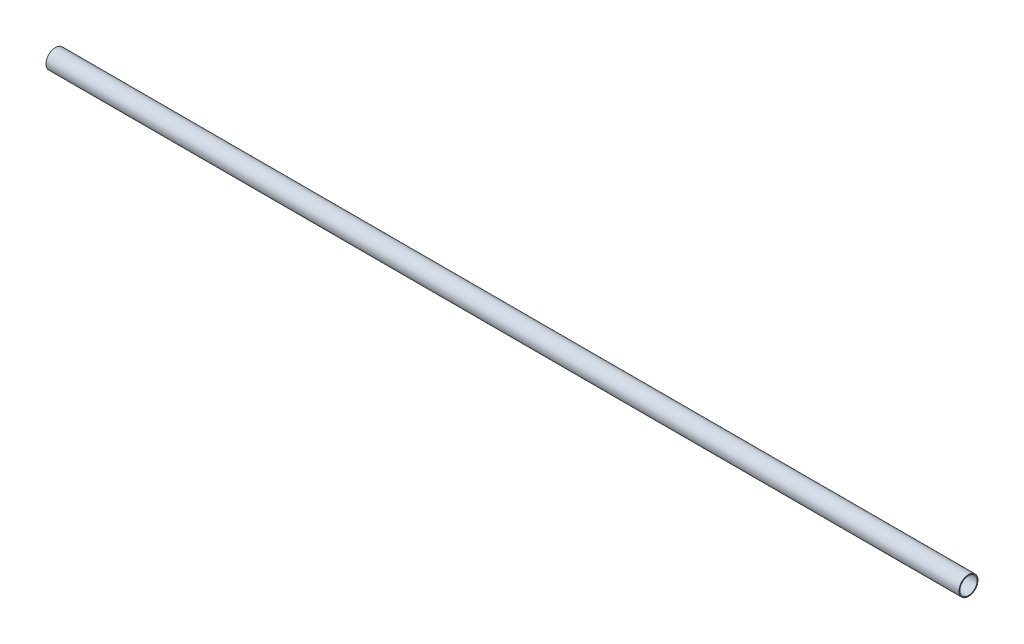
ISO-10303-21;
HEADER;
FILE_DESCRIPTION(('STEP AP214'),'2;1');
FILE_NAME('part.step','',(''),(''),'','','');
FILE_SCHEMA(('AUTOMOTIVE_DESIGN { 1 0 10303 214 1 1 1 1 }'));
ENDSEC;
DATA;
#1=APPLICATION_CONTEXT('core data for automotive mechanical design processes');
#2=APPLICATION_PROTOCOL_DEFINITION('international standard','automotive_design',2000,#1);
#3=PRODUCT_CONTEXT('',#1,'mechanical');
#4=PRODUCT('Part','Part','',(#3));
#5=PRODUCT_RELATED_PRODUCT_CATEGORY('part','',(#4));
#6=PRODUCT_DEFINITION_FORMATION('','',#4);
#7=PRODUCT_DEFINITION_CONTEXT('part definition',#1,'design');
#8=PRODUCT_DEFINITION('design','',#6,#7);
#9=PRODUCT_DEFINITION_SHAPE('','',#8);
#10=(LENGTH_UNIT() NAMED_UNIT(*) SI_UNIT(.MILLI.,.METRE.));
#11=(NAMED_UNIT(*) PLANE_ANGLE_UNIT() SI_UNIT($,.RADIAN.));
#12=(NAMED_UNIT(*) SI_UNIT($,.STERADIAN.) SOLID_ANGLE_UNIT());
#13=UNCERTAINTY_MEASURE_WITH_UNIT(LENGTH_MEASURE(1.E-05),#10,'distance_accuracy_value','');
#14=(GEOMETRIC_REPRESENTATION_CONTEXT(3) GLOBAL_UNCERTAINTY_ASSIGNED_CONTEXT((#13)) GLOBAL_UNIT_ASSIGNED_CONTEXT((#10,
#11,#12)) REPRESENTATION_CONTEXT('',''));
#15=CARTESIAN_POINT('',(0.,0.,0.));
#16=DIRECTION('',(0.,0.,1.));
#17=DIRECTION('',(1.,0.,0.));
#18=AXIS2_PLACEMENT_3D('',#15,#16,#17);
#19=CARTESIAN_POINT('',(457.2,0.,0.));
#20=DIRECTION('',(1.,0.,0.));
#21=DIRECTION('',(0.,0.,-1.));
#22=AXIS2_PLACEMENT_3D('',#19,#20,#21);
#23=PLANE('',#22);
#24=CARTESIAN_POINT('',(457.2,0.,0.));
#25=DIRECTION('',(1.,0.,0.));
#26=DIRECTION('',(0.,0.,-1.));
#27=AXIS2_PLACEMENT_3D('',#24,#25,#26);
#28=CIRCLE('',#27,9.525);
#29=CARTESIAN_POINT('',(457.2,0.,-9.525));
#30=VERTEX_POINT('',#29);
#31=EDGE_CURVE('E10',#30,#30,#28,.T.);
#32=ORIENTED_EDGE('',*,*,#31,.T.);
#33=EDGE_LOOP('',(#32));
#34=FACE_BOUND('',#33,.T.);
#35=CARTESIAN_POINT('',(457.2,0.,0.));
#36=DIRECTION('',(1.,0.,0.));
#37=DIRECTION('',(0.,0.,-1.));
#38=AXIS2_PLACEMENT_3D('',#35,#36,#37);
#39=CIRCLE('',#38,8.636);
#40=CARTESIAN_POINT('',(457.2,0.,-8.636));
#41=VERTEX_POINT('',#40);
#42=EDGE_CURVE('E41',#41,#41,#39,.T.);
#43=ORIENTED_EDGE('',*,*,#42,.F.);
#44=EDGE_LOOP('',(#43));
#45=FACE_BOUND('',#44,.T.);
#46=ADVANCED_FACE('F30',(#34,#45),#23,.T.);
#47=CARTESIAN_POINT('',(-457.2,0.,0.));
#48=DIRECTION('',(1.,0.,0.));
#49=DIRECTION('',(0.,0.,-1.));
#50=AXIS2_PLACEMENT_3D('',#47,#48,#49);
#51=PLANE('',#50);
#52=CARTESIAN_POINT('',(-457.2,0.,0.));
#53=DIRECTION('',(1.,0.,0.));
#54=DIRECTION('',(0.,0.,-1.));
#55=AXIS2_PLACEMENT_3D('',#52,#53,#54);
#56=CIRCLE('',#55,9.525);
#57=CARTESIAN_POINT('',(-457.2,0.,-9.525));
#58=VERTEX_POINT('',#57);
#59=EDGE_CURVE('E34',#58,#58,#56,.T.);
#60=ORIENTED_EDGE('',*,*,#59,.F.);
#61=EDGE_LOOP('',(#60));
#62=FACE_BOUND('',#61,.T.);
#63=CARTESIAN_POINT('',(-457.2,0.,0.));
#64=DIRECTION('',(1.,0.,0.));
#65=DIRECTION('',(0.,0.,-1.));
#66=AXIS2_PLACEMENT_3D('',#63,#64,#65);
#67=CIRCLE('',#66,8.636);
#68=CARTESIAN_POINT('',(-457.2,0.,-8.636));
#69=VERTEX_POINT('',#68);
#70=EDGE_CURVE('E43',#69,#69,#67,.T.);
#71=ORIENTED_EDGE('',*,*,#70,.T.);
#72=EDGE_LOOP('',(#71));
#73=FACE_BOUND('',#72,.T.);
#74=ADVANCED_FACE('F53',(#62,#73),#51,.F.);
#75=CARTESIAN_POINT('',(457.2,0.,0.));
#76=DIRECTION('',(-1.,0.,0.));
#77=DIRECTION('',(0.,0.,1.));
#78=AXIS2_PLACEMENT_3D('',#75,#76,#77);
#79=CYLINDRICAL_SURFACE('',#78,9.525);
#80=ORIENTED_EDGE('',*,*,#31,.F.);
#81=EDGE_LOOP('',(#80));
#82=FACE_BOUND('',#81,.T.);
#83=ORIENTED_EDGE('',*,*,#59,.T.);
#84=EDGE_LOOP('',(#83));
#85=FACE_BOUND('',#84,.T.);
#86=ADVANCED_FACE('F32',(#82,#85),#79,.T.);
#87=CARTESIAN_POINT('',(457.2,0.,0.));
#88=DIRECTION('',(-1.,0.,0.));
#89=DIRECTION('',(0.,0.,1.));
#90=AXIS2_PLACEMENT_3D('',#87,#88,#89);
#91=CYLINDRICAL_SURFACE('',#90,8.636);
#92=ORIENTED_EDGE('',*,*,#42,.T.);
#93=EDGE_LOOP('',(#92));
#94=FACE_BOUND('',#93,.T.);
#95=ORIENTED_EDGE('',*,*,#70,.F.);
#96=EDGE_LOOP('',(#95));
#97=FACE_BOUND('',#96,.T.);
#98=ADVANCED_FACE('F49',(#94,#97),#91,.F.);
#99=CLOSED_SHELL('',(#46,#74,#86,#98));
#100=MANIFOLD_SOLID_BREP('B2',#99);
#101=ADVANCED_BREP_SHAPE_REPRESENTATION('',(#18,#100),#14);
#102=SHAPE_DEFINITION_REPRESENTATION(#9,#101);
ENDSEC;
END-ISO-10303-21;
